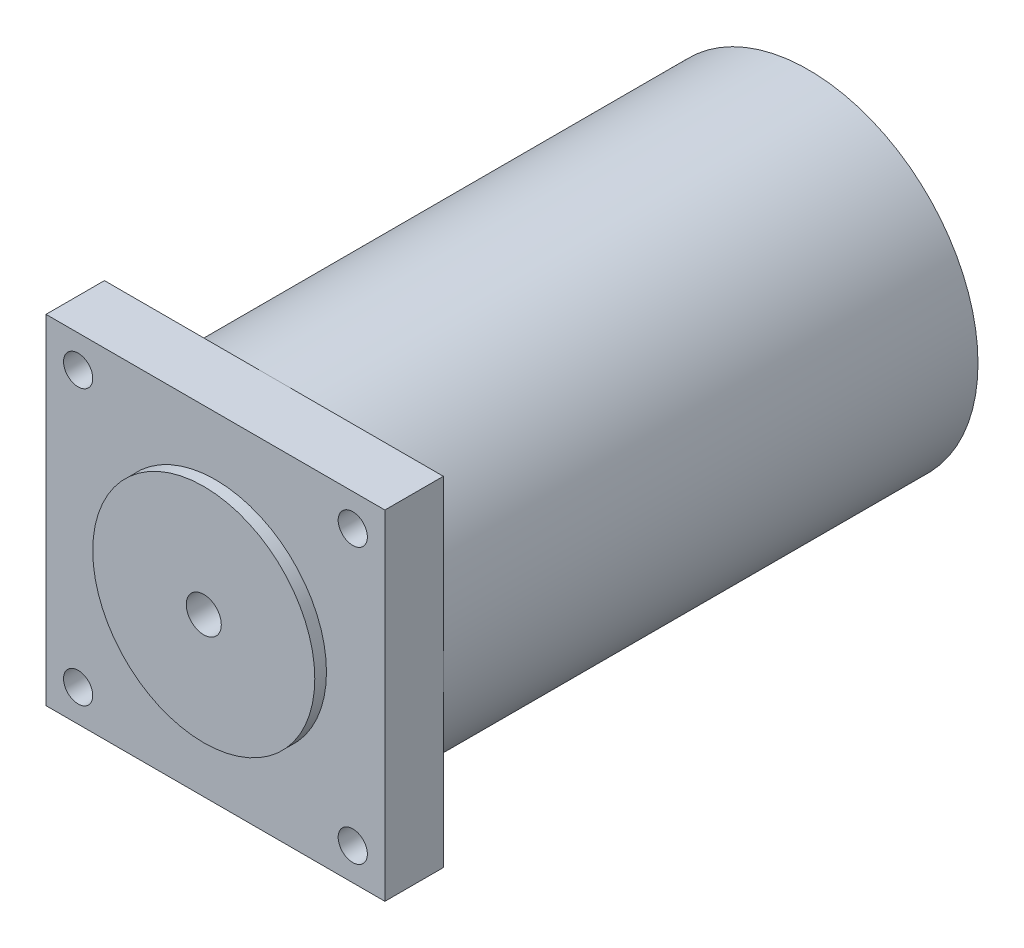
ISO-10303-21;
HEADER;
FILE_DESCRIPTION(('STEP AP214'),'2;1');
FILE_NAME('part.step','',(''),(''),'','','');
FILE_SCHEMA(('AUTOMOTIVE_DESIGN { 1 0 10303 214 1 1 1 1 }'));
ENDSEC;
DATA;
#1=APPLICATION_CONTEXT('core data for automotive mechanical design processes');
#2=APPLICATION_PROTOCOL_DEFINITION('international standard','automotive_design',2000,#1);
#3=PRODUCT_CONTEXT('',#1,'mechanical');
#4=PRODUCT('Part','Part','',(#3));
#5=PRODUCT_RELATED_PRODUCT_CATEGORY('part','',(#4));
#6=PRODUCT_DEFINITION_FORMATION('','',#4);
#7=PRODUCT_DEFINITION_CONTEXT('part definition',#1,'design');
#8=PRODUCT_DEFINITION('design','',#6,#7);
#9=PRODUCT_DEFINITION_SHAPE('','',#8);
#10=(LENGTH_UNIT() NAMED_UNIT(*) SI_UNIT(.MILLI.,.METRE.));
#11=(NAMED_UNIT(*) PLANE_ANGLE_UNIT() SI_UNIT($,.RADIAN.));
#12=(NAMED_UNIT(*) SI_UNIT($,.STERADIAN.) SOLID_ANGLE_UNIT());
#13=UNCERTAINTY_MEASURE_WITH_UNIT(LENGTH_MEASURE(1.E-05),#10,'distance_accuracy_value','');
#14=(GEOMETRIC_REPRESENTATION_CONTEXT(3) GLOBAL_UNCERTAINTY_ASSIGNED_CONTEXT((#13)) GLOBAL_UNIT_ASSIGNED_CONTEXT((#10,
#11,#12)) REPRESENTATION_CONTEXT('',''));
#15=CARTESIAN_POINT('',(0.,0.,0.));
#16=DIRECTION('',(0.,0.,1.));
#17=DIRECTION('',(1.,0.,0.));
#18=AXIS2_PLACEMENT_3D('',#15,#16,#17);
#19=CARTESIAN_POINT('',(0.,0.,-12.));
#20=DIRECTION('',(0.,0.,-1.));
#21=DIRECTION('',(-1.,0.,0.));
#22=AXIS2_PLACEMENT_3D('',#19,#20,#21);
#23=PLANE('',#22);
#24=CARTESIAN_POINT('',(-23.5,23.5,-12.));
#25=DIRECTION('',(0.,0.,1.));
#26=DIRECTION('',(1.,0.,0.));
#27=AXIS2_PLACEMENT_3D('',#24,#25,#26);
#28=CIRCLE('',#27,2.5);
#29=CARTESIAN_POINT('',(-21.,23.5,-12.));
#30=VERTEX_POINT('',#29);
#31=EDGE_CURVE('E112',#30,#30,#28,.T.);
#32=ORIENTED_EDGE('',*,*,#31,.T.);
#33=EDGE_LOOP('',(#32));
#34=FACE_BOUND('',#33,.T.);
#35=CARTESIAN_POINT('',(0.,0.,-12.));
#36=DIRECTION('',(0.,0.,-1.));
#37=DIRECTION('',(-1.,0.,0.));
#38=AXIS2_PLACEMENT_3D('',#35,#36,#37);
#39=CIRCLE('',#38,29.);
#40=CARTESIAN_POINT('',(-29.,0.,-12.));
#41=VERTEX_POINT('',#40);
#42=CARTESIAN_POINT('',(0.,29.,-12.));
#43=VERTEX_POINT('',#42);
#44=EDGE_CURVE('E108',#41,#43,#39,.T.);
#45=ORIENTED_EDGE('',*,*,#44,.F.);
#46=DIRECTION('',(0.,1.,0.));
#47=VECTOR('',#46,1.);
#48=CARTESIAN_POINT('',(-29.,29.,-12.));
#49=LINE('',#48,#47);
#50=CARTESIAN_POINT('',(-29.,29.,-12.));
#51=VERTEX_POINT('',#50);
#52=EDGE_CURVE('E96',#41,#51,#49,.T.);
#53=ORIENTED_EDGE('',*,*,#52,.T.);
#54=DIRECTION('',(1.,0.,0.));
#55=VECTOR('',#54,1.);
#56=CARTESIAN_POINT('',(29.,29.,-12.));
#57=LINE('',#56,#55);
#58=EDGE_CURVE('E109',#51,#43,#57,.T.);
#59=ORIENTED_EDGE('',*,*,#58,.T.);
#60=EDGE_LOOP('',(#45,#53,#59));
#61=FACE_BOUND('',#60,.T.);
#62=ADVANCED_FACE('F33',(#34,#61),#23,.T.);
#63=CARTESIAN_POINT('',(23.5,23.5,-12.));
#64=DIRECTION('',(0.,0.,1.));
#65=DIRECTION('',(-1.,0.,0.));
#66=AXIS2_PLACEMENT_3D('',#63,#64,#65);
#67=CIRCLE('',#66,2.5);
#68=CARTESIAN_POINT('',(21.,23.5,-12.));
#69=VERTEX_POINT('',#68);
#70=EDGE_CURVE('E227',#69,#69,#67,.T.);
#71=ORIENTED_EDGE('',*,*,#70,.T.);
#72=EDGE_LOOP('',(#71));
#73=FACE_BOUND('',#72,.T.);
#74=CARTESIAN_POINT('',(29.,0.,-12.));
#75=VERTEX_POINT('',#74);
#76=EDGE_CURVE('E45',#43,#75,#39,.T.);
#77=ORIENTED_EDGE('',*,*,#76,.F.);
#78=CARTESIAN_POINT('',(29.,29.,-12.));
#79=VERTEX_POINT('',#78);
#80=EDGE_CURVE('E95',#43,#79,#57,.T.);
#81=ORIENTED_EDGE('',*,*,#80,.T.);
#82=DIRECTION('',(0.,-1.,0.));
#83=VECTOR('',#82,1.);
#84=CARTESIAN_POINT('',(29.,29.,-12.));
#85=LINE('',#84,#83);
#86=EDGE_CURVE('E123',#79,#75,#85,.T.);
#87=ORIENTED_EDGE('',*,*,#86,.T.);
#88=EDGE_LOOP('',(#77,#81,#87));
#89=FACE_BOUND('',#88,.T.);
#90=ADVANCED_FACE('F168',(#73,#89),#23,.T.);
#91=CARTESIAN_POINT('',(23.5,-23.5,-12.));
#92=DIRECTION('',(0.,0.,1.));
#93=DIRECTION('',(1.,0.,0.));
#94=AXIS2_PLACEMENT_3D('',#91,#92,#93);
#95=CIRCLE('',#94,2.5);
#96=CARTESIAN_POINT('',(26.,-23.5,-12.));
#97=VERTEX_POINT('',#96);
#98=EDGE_CURVE('E221',#97,#97,#95,.T.);
#99=ORIENTED_EDGE('',*,*,#98,.T.);
#100=EDGE_LOOP('',(#99));
#101=FACE_BOUND('',#100,.T.);
#102=CARTESIAN_POINT('',(0.,-29.,-12.));
#103=VERTEX_POINT('',#102);
#104=EDGE_CURVE('E116',#75,#103,#39,.T.);
#105=ORIENTED_EDGE('',*,*,#104,.F.);
#106=CARTESIAN_POINT('',(29.,-29.,-12.));
#107=VERTEX_POINT('',#106);
#108=EDGE_CURVE('E125',#75,#107,#85,.T.);
#109=ORIENTED_EDGE('',*,*,#108,.T.);
#110=DIRECTION('',(-1.,0.,0.));
#111=VECTOR('',#110,1.);
#112=CARTESIAN_POINT('',(29.,-29.,-12.));
#113=LINE('',#112,#111);
#114=EDGE_CURVE('E106',#107,#103,#113,.T.);
#115=ORIENTED_EDGE('',*,*,#114,.T.);
#116=EDGE_LOOP('',(#105,#109,#115));
#117=FACE_BOUND('',#116,.T.);
#118=ADVANCED_FACE('F170',(#101,#117),#23,.T.);
#119=CARTESIAN_POINT('',(0.,0.,-2.));
#120=DIRECTION('',(0.,0.,1.));
#121=DIRECTION('',(1.,0.,0.));
#122=AXIS2_PLACEMENT_3D('',#119,#120,#121);
#123=CYLINDRICAL_SURFACE('',#122,19.);
#124=CARTESIAN_POINT('',(0.,0.,-2.));
#125=DIRECTION('',(0.,0.,-1.));
#126=DIRECTION('',(-1.,0.,0.));
#127=AXIS2_PLACEMENT_3D('',#124,#125,#126);
#128=CIRCLE('',#127,19.);
#129=CARTESIAN_POINT('',(-19.,0.,-2.));
#130=VERTEX_POINT('',#129);
#131=EDGE_CURVE('E119',#130,#130,#128,.F.);
#132=ORIENTED_EDGE('',*,*,#131,.T.);
#133=EDGE_LOOP('',(#132));
#134=FACE_BOUND('',#133,.T.);
#135=CARTESIAN_POINT('',(0.,0.,0.));
#136=DIRECTION('',(0.,0.,1.));
#137=DIRECTION('',(1.,0.,0.));
#138=AXIS2_PLACEMENT_3D('',#135,#136,#137);
#139=CIRCLE('',#138,19.);
#140=CARTESIAN_POINT('',(19.,0.,0.));
#141=VERTEX_POINT('',#140);
#142=EDGE_CURVE('E117',#141,#141,#139,.T.);
#143=ORIENTED_EDGE('',*,*,#142,.F.);
#144=EDGE_LOOP('',(#143));
#145=FACE_BOUND('',#144,.T.);
#146=ADVANCED_FACE('F35',(#134,#145),#123,.T.);
#147=CARTESIAN_POINT('',(0.,0.,0.));
#148=DIRECTION('',(0.,0.,1.));
#149=DIRECTION('',(1.,0.,0.));
#150=AXIS2_PLACEMENT_3D('',#147,#148,#149);
#151=PLANE('',#150);
#152=CARTESIAN_POINT('',(0.,0.,0.));
#153=DIRECTION('',(0.,0.,1.));
#154=DIRECTION('',(1.,0.,0.));
#155=AXIS2_PLACEMENT_3D('',#152,#153,#154);
#156=CIRCLE('',#155,3.);
#157=CARTESIAN_POINT('',(3.,0.,0.));
#158=VERTEX_POINT('',#157);
#159=EDGE_CURVE('E203',#158,#158,#156,.T.);
#160=ORIENTED_EDGE('',*,*,#159,.F.);
#161=EDGE_LOOP('',(#160));
#162=FACE_BOUND('',#161,.T.);
#163=ORIENTED_EDGE('',*,*,#142,.T.);
#164=EDGE_LOOP('',(#163));
#165=FACE_BOUND('',#164,.T.);
#166=ADVANCED_FACE('F194',(#162,#165),#151,.T.);
#167=CARTESIAN_POINT('',(29.,29.,-12.));
#168=DIRECTION('',(-1.,0.,0.));
#169=DIRECTION('',(0.,0.,1.));
#170=AXIS2_PLACEMENT_3D('',#167,#168,#169);
#171=PLANE('',#170);
#172=DIRECTION('',(0.,-1.,0.));
#173=VECTOR('',#172,1.);
#174=CARTESIAN_POINT('',(29.,29.,-2.));
#175=LINE('',#174,#173);
#176=CARTESIAN_POINT('',(29.,29.,-2.));
#177=VERTEX_POINT('',#176);
#178=CARTESIAN_POINT('',(29.,-29.,-2.));
#179=VERTEX_POINT('',#178);
#180=EDGE_CURVE('E130',#177,#179,#175,.T.);
#181=ORIENTED_EDGE('',*,*,#180,.T.);
#182=DIRECTION('',(0.,0.,1.));
#183=VECTOR('',#182,1.);
#184=CARTESIAN_POINT('',(29.,-29.,-12.));
#185=LINE('',#184,#183);
#186=EDGE_CURVE('E144',#107,#179,#185,.T.);
#187=ORIENTED_EDGE('',*,*,#186,.F.);
#188=ORIENTED_EDGE('',*,*,#108,.F.);
#189=ORIENTED_EDGE('',*,*,#86,.F.);
#190=DIRECTION('',(0.,0.,1.));
#191=VECTOR('',#190,1.);
#192=CARTESIAN_POINT('',(29.,29.,-12.));
#193=LINE('',#192,#191);
#194=EDGE_CURVE('E129',#79,#177,#193,.T.);
#195=ORIENTED_EDGE('',*,*,#194,.T.);
#196=EDGE_LOOP('',(#181,#187,#188,#189,#195));
#197=FACE_BOUND('',#196,.T.);
#198=ADVANCED_FACE('F162',(#197),#171,.F.);
#199=CARTESIAN_POINT('',(29.,-29.,-12.));
#200=DIRECTION('',(0.,1.,0.));
#201=DIRECTION('',(-1.,0.,0.));
#202=AXIS2_PLACEMENT_3D('',#199,#200,#201);
#203=PLANE('',#202);
#204=DIRECTION('',(-1.,0.,0.));
#205=VECTOR('',#204,1.);
#206=CARTESIAN_POINT('',(29.,-29.,-2.));
#207=LINE('',#206,#205);
#208=CARTESIAN_POINT('',(-29.,-29.,-2.));
#209=VERTEX_POINT('',#208);
#210=EDGE_CURVE('E133',#179,#209,#207,.T.);
#211=ORIENTED_EDGE('',*,*,#210,.T.);
#212=DIRECTION('',(0.,0.,1.));
#213=VECTOR('',#212,1.);
#214=CARTESIAN_POINT('',(-29.,-29.,-12.));
#215=LINE('',#214,#213);
#216=CARTESIAN_POINT('',(-29.,-29.,-12.));
#217=VERTEX_POINT('',#216);
#218=EDGE_CURVE('E142',#217,#209,#215,.T.);
#219=ORIENTED_EDGE('',*,*,#218,.F.);
#220=EDGE_CURVE('E91',#103,#217,#113,.T.);
#221=ORIENTED_EDGE('',*,*,#220,.F.);
#222=ORIENTED_EDGE('',*,*,#114,.F.);
#223=ORIENTED_EDGE('',*,*,#186,.T.);
#224=EDGE_LOOP('',(#211,#219,#221,#222,#223));
#225=FACE_BOUND('',#224,.T.);
#226=ADVANCED_FACE('F189',(#225),#203,.F.);
#227=CARTESIAN_POINT('',(-29.,29.,-12.));
#228=DIRECTION('',(1.,0.,0.));
#229=DIRECTION('',(0.,0.,-1.));
#230=AXIS2_PLACEMENT_3D('',#227,#228,#229);
#231=PLANE('',#230);
#232=DIRECTION('',(0.,1.,0.));
#233=VECTOR('',#232,1.);
#234=CARTESIAN_POINT('',(-29.,29.,-2.));
#235=LINE('',#234,#233);
#236=CARTESIAN_POINT('',(-29.,29.,-2.));
#237=VERTEX_POINT('',#236);
#238=EDGE_CURVE('E135',#209,#237,#235,.T.);
#239=ORIENTED_EDGE('',*,*,#238,.T.);
#240=DIRECTION('',(0.,0.,1.));
#241=VECTOR('',#240,1.);
#242=CARTESIAN_POINT('',(-29.,29.,-12.));
#243=LINE('',#242,#241);
#244=EDGE_CURVE('E102',#51,#237,#243,.T.);
#245=ORIENTED_EDGE('',*,*,#244,.F.);
#246=ORIENTED_EDGE('',*,*,#52,.F.);
#247=EDGE_CURVE('E88',#217,#41,#49,.T.);
#248=ORIENTED_EDGE('',*,*,#247,.F.);
#249=ORIENTED_EDGE('',*,*,#218,.T.);
#250=EDGE_LOOP('',(#239,#245,#246,#248,#249));
#251=FACE_BOUND('',#250,.T.);
#252=ADVANCED_FACE('F100',(#251),#231,.F.);
#253=CARTESIAN_POINT('',(29.,29.,-12.));
#254=DIRECTION('',(0.,-1.,0.));
#255=DIRECTION('',(0.,0.,-1.));
#256=AXIS2_PLACEMENT_3D('',#253,#254,#255);
#257=PLANE('',#256);
#258=DIRECTION('',(1.,0.,0.));
#259=VECTOR('',#258,1.);
#260=CARTESIAN_POINT('',(29.,29.,-2.));
#261=LINE('',#260,#259);
#262=EDGE_CURVE('E137',#237,#177,#261,.T.);
#263=ORIENTED_EDGE('',*,*,#262,.T.);
#264=ORIENTED_EDGE('',*,*,#194,.F.);
#265=ORIENTED_EDGE('',*,*,#80,.F.);
#266=ORIENTED_EDGE('',*,*,#58,.F.);
#267=ORIENTED_EDGE('',*,*,#244,.T.);
#268=EDGE_LOOP('',(#263,#264,#265,#266,#267));
#269=FACE_BOUND('',#268,.T.);
#270=ADVANCED_FACE('F167',(#269),#257,.F.);
#271=CARTESIAN_POINT('',(-23.5,-23.5,-12.));
#272=DIRECTION('',(0.,0.,1.));
#273=DIRECTION('',(-1.,0.,0.));
#274=AXIS2_PLACEMENT_3D('',#271,#272,#273);
#275=CIRCLE('',#274,2.5);
#276=CARTESIAN_POINT('',(-26.,-23.5,-12.));
#277=VERTEX_POINT('',#276);
#278=EDGE_CURVE('E215',#277,#277,#275,.T.);
#279=ORIENTED_EDGE('',*,*,#278,.T.);
#280=EDGE_LOOP('',(#279));
#281=FACE_BOUND('',#280,.T.);
#282=EDGE_CURVE('E59',#103,#41,#39,.T.);
#283=ORIENTED_EDGE('',*,*,#282,.F.);
#284=ORIENTED_EDGE('',*,*,#220,.T.);
#285=ORIENTED_EDGE('',*,*,#247,.T.);
#286=EDGE_LOOP('',(#283,#284,#285));
#287=FACE_BOUND('',#286,.T.);
#288=ADVANCED_FACE('F90',(#281,#287),#23,.T.);
#289=CARTESIAN_POINT('',(0.,0.,-2.));
#290=DIRECTION('',(0.,0.,-1.));
#291=DIRECTION('',(-1.,0.,0.));
#292=AXIS2_PLACEMENT_3D('',#289,#290,#291);
#293=PLANE('',#292);
#294=CARTESIAN_POINT('',(-23.5,-23.5,-2.));
#295=DIRECTION('',(0.,0.,1.));
#296=DIRECTION('',(-1.,0.,0.));
#297=AXIS2_PLACEMENT_3D('',#294,#295,#296);
#298=CIRCLE('',#297,2.5);
#299=CARTESIAN_POINT('',(-26.,-23.5,-2.));
#300=VERTEX_POINT('',#299);
#301=EDGE_CURVE('E210',#300,#300,#298,.T.);
#302=ORIENTED_EDGE('',*,*,#301,.F.);
#303=EDGE_LOOP('',(#302));
#304=FACE_BOUND('',#303,.T.);
#305=CARTESIAN_POINT('',(23.5,-23.5,-2.));
#306=DIRECTION('',(0.,0.,1.));
#307=DIRECTION('',(1.,0.,0.));
#308=AXIS2_PLACEMENT_3D('',#305,#306,#307);
#309=CIRCLE('',#308,2.5);
#310=CARTESIAN_POINT('',(26.,-23.5,-2.));
#311=VERTEX_POINT('',#310);
#312=EDGE_CURVE('E218',#311,#311,#309,.T.);
#313=ORIENTED_EDGE('',*,*,#312,.F.);
#314=EDGE_LOOP('',(#313));
#315=FACE_BOUND('',#314,.T.);
#316=CARTESIAN_POINT('',(23.5,23.5,-2.));
#317=DIRECTION('',(0.,0.,1.));
#318=DIRECTION('',(-1.,0.,0.));
#319=AXIS2_PLACEMENT_3D('',#316,#317,#318);
#320=CIRCLE('',#319,2.5);
#321=CARTESIAN_POINT('',(21.,23.5,-2.));
#322=VERTEX_POINT('',#321);
#323=EDGE_CURVE('E224',#322,#322,#320,.T.);
#324=ORIENTED_EDGE('',*,*,#323,.F.);
#325=EDGE_LOOP('',(#324));
#326=FACE_BOUND('',#325,.T.);
#327=CARTESIAN_POINT('',(-23.5,23.5,-2.));
#328=DIRECTION('',(0.,0.,1.));
#329=DIRECTION('',(1.,0.,0.));
#330=AXIS2_PLACEMENT_3D('',#327,#328,#329);
#331=CIRCLE('',#330,2.5);
#332=CARTESIAN_POINT('',(-21.,23.5,-2.));
#333=VERTEX_POINT('',#332);
#334=EDGE_CURVE('E229',#333,#333,#331,.T.);
#335=ORIENTED_EDGE('',*,*,#334,.F.);
#336=EDGE_LOOP('',(#335));
#337=FACE_BOUND('',#336,.T.);
#338=ORIENTED_EDGE('',*,*,#131,.F.);
#339=EDGE_LOOP('',(#338));
#340=FACE_BOUND('',#339,.T.);
#341=ORIENTED_EDGE('',*,*,#180,.F.);
#342=ORIENTED_EDGE('',*,*,#262,.F.);
#343=ORIENTED_EDGE('',*,*,#238,.F.);
#344=ORIENTED_EDGE('',*,*,#210,.F.);
#345=EDGE_LOOP('',(#341,#342,#343,#344));
#346=FACE_BOUND('',#345,.T.);
#347=ADVANCED_FACE('F152',(#304,#315,#326,#337,#340,#346),#293,.F.);
#348=CARTESIAN_POINT('',(0.,0.,-103.5));
#349=DIRECTION('',(0.,0.,1.));
#350=DIRECTION('',(1.,0.,0.));
#351=AXIS2_PLACEMENT_3D('',#348,#349,#350);
#352=CYLINDRICAL_SURFACE('',#351,29.);
#353=CARTESIAN_POINT('',(-29.,0.,-90.));
#354=CARTESIAN_POINT('',(-28.9999994814004,0.0841952568733352,-89.999996285564));
#355=CARTESIAN_POINT('',(-28.999629409528,0.168450128231977,-89.992887348596));
#356=CARTESIAN_POINT('',(-28.9981886967874,0.334635306466976,-89.9646293585502));
#357=CARTESIAN_POINT('',(-28.99711723176,0.416562760241089,-89.9434637880521));
#358=CARTESIAN_POINT('',(-28.994394997039,0.575661719286378,-89.887700387204));
#359=CARTESIAN_POINT('',(-28.9927445239121,0.652835635564873,-89.8531094323433));
#360=CARTESIAN_POINT('',(-28.9890501248228,0.800260819726807,-89.7714878113173));
#361=CARTESIAN_POINT('',(-28.9870062914241,0.870513710365758,-89.7244600707473));
#362=CARTESIAN_POINT('',(-28.9827526204579,1.00219868527525,-89.6192438970584));
#363=CARTESIAN_POINT('',(-28.9805426289382,1.06362243168234,-89.5610450339458));
#364=CARTESIAN_POINT('',(-28.9762070467588,1.17583443056522,-89.4351596054024));
#365=CARTESIAN_POINT('',(-28.9740814595594,1.22662224736012,-89.3674726514993));
#366=CARTESIAN_POINT('',(-28.9701532754793,1.31614415555075,-89.224488096196));
#367=CARTESIAN_POINT('',(-28.9683508551826,1.35487166544372,-89.1491863688794));
#368=CARTESIAN_POINT('',(-28.965274155424,1.41913142371409,-88.9931388305909));
#369=CARTESIAN_POINT('',(-28.9639998717462,1.44466377742115,-88.9123930630815));
#370=CARTESIAN_POINT('',(-28.9621245481971,1.48178623562018,-88.7478268449756));
#371=CARTESIAN_POINT('',(-28.9615229010872,1.49338891615407,-88.6640092382833));
#372=CARTESIAN_POINT('',(-28.9610588749841,1.50236147501093,-88.4956140489785));
#373=CARTESIAN_POINT('',(-28.9611964898406,1.49973147174335,-88.4110364726943));
#374=CARTESIAN_POINT('',(-28.9621949047086,1.48032378915431,-88.2436076986657));
#375=CARTESIAN_POINT('',(-28.9630550100155,1.46355970028624,-88.1607549208528));
#376=CARTESIAN_POINT('',(-28.9654003710499,1.41638078069162,-87.9990410408175));
#377=CARTESIAN_POINT('',(-28.9668856295571,1.3859658892663,-87.9201799563461));
#378=CARTESIAN_POINT('',(-28.9703146988802,1.31233322244595,-87.768644271517));
#379=CARTESIAN_POINT('',(-28.9722587313834,1.2691092548968,-87.6959726852067));
#380=CARTESIAN_POINT('',(-28.9763860157147,1.17108991348463,-87.5589118404958));
#381=CARTESIAN_POINT('',(-28.9785692693558,1.11629445191383,-87.4945226448787));
#382=CARTESIAN_POINT('',(-28.9829320138345,0.996610889898645,-87.3757752571403));
#383=CARTESIAN_POINT('',(-28.9851114972501,0.93171102146714,-87.3214289248008));
#384=CARTESIAN_POINT('',(-28.9892185895455,0.793702259670564,-87.2244013562772));
#385=CARTESIAN_POINT('',(-28.9911461983604,0.720593364192884,-87.1817201230952));
#386=CARTESIAN_POINT('',(-28.9945323936625,0.56823487191116,-87.109235436918));
#387=CARTESIAN_POINT('',(-28.9959909649161,0.488985075763274,-87.0794324021772));
#388=CARTESIAN_POINT('',(-28.99827448507,0.326597487471827,-87.0335578848933));
#389=CARTESIAN_POINT('',(-28.9990994390449,0.243459726472143,-87.0174862923766));
#390=CARTESIAN_POINT('',(-29.0000221002627,0.0757591356689684,-86.9995455000349));
#391=CARTESIAN_POINT('',(-29.0001206474517,-0.00880193487156638,-86.9976598968592));
#392=CARTESIAN_POINT('',(-28.9995816194342,-0.177039267823699,-87.008101794759));
#393=CARTESIAN_POINT('',(-28.9989440468361,-0.260715533369488,-87.0204292454714));
#394=CARTESIAN_POINT('',(-28.9970051267962,-0.424761998819716,-87.0589337427039));
#395=CARTESIAN_POINT('',(-28.9957041385483,-0.505133962356042,-87.0851032949644));
#396=CARTESIAN_POINT('',(-28.9925848471614,-0.660344699611395,-87.1505415381838));
#397=CARTESIAN_POINT('',(-28.9907665408341,-0.73518343922581,-87.189810309873));
#398=CARTESIAN_POINT('',(-28.9868150412848,-0.877278624557046,-87.2803742623094));
#399=CARTESIAN_POINT('',(-28.9846815609571,-0.94452805726732,-87.3316804337808));
#400=CARTESIAN_POINT('',(-28.9803409216317,-1.06946513977656,-87.4448467415006));
#401=CARTESIAN_POINT('',(-28.97813376213,-1.12715272415435,-87.5067069499529));
#402=CARTESIAN_POINT('',(-28.9738921325879,-1.23138383825736,-87.639295938405));
#403=CARTESIAN_POINT('',(-28.9718578282446,-1.27791675132627,-87.7100330704098));
#404=CARTESIAN_POINT('',(-28.9681939186281,-1.3584450557728,-87.8583257657261));
#405=CARTESIAN_POINT('',(-28.9665643115014,-1.39244050457188,-87.9358812978074));
#406=CARTESIAN_POINT('',(-28.9638947455094,-1.44691037878997,-88.0955700131851));
#407=CARTESIAN_POINT('',(-28.9628544919943,-1.46739156156762,-88.1777008864219));
#408=CARTESIAN_POINT('',(-28.9614801126643,-1.49427361516323,-88.3442411872332));
#409=CARTESIAN_POINT('',(-28.9611459824674,-1.50067457335729,-88.4286506006647));
#410=CARTESIAN_POINT('',(-28.9612216369391,-1.49921365171567,-88.5972462457095));
#411=CARTESIAN_POINT('',(-28.9616305505706,-1.49136847199661,-88.6814326229357));
#412=CARTESIAN_POINT('',(-28.9631443648258,-1.46167250473789,-88.8472913028772));
#413=CARTESIAN_POINT('',(-28.9642492667687,-1.43982169065088,-88.9289636008267));
#414=CARTESIAN_POINT('',(-28.9670303303492,-1.38273818302386,-89.0874790977661));
#415=CARTESIAN_POINT('',(-28.9687064953284,-1.34750541120768,-89.1643222685054));
#416=CARTESIAN_POINT('',(-28.9724411218353,-1.2646608963442,-89.3110038587283));
#417=CARTESIAN_POINT('',(-28.9744995718613,-1.21704952571139,-89.3808424888583));
#418=CARTESIAN_POINT('',(-28.9787695317164,-1.11073916628571,-89.5116161802099));
#419=CARTESIAN_POINT('',(-28.9809812017525,-1.05202845767749,-89.5725417083404));
#420=CARTESIAN_POINT('',(-28.9853071615423,-0.925195196656793,-89.6836911299586));
#421=CARTESIAN_POINT('',(-28.9874214272223,-0.857070333981883,-89.7339123888707));
#422=CARTESIAN_POINT('',(-28.9913158872774,-0.713286126999061,-89.822252824604));
#423=CARTESIAN_POINT('',(-28.9930957479604,-0.637619370873319,-89.8603599390688));
#424=CARTESIAN_POINT('',(-28.9961159255912,-0.481009048877493,-89.9232834444534));
#425=CARTESIAN_POINT('',(-28.9973568788256,-0.400071836437397,-89.9481155172337));
#426=CARTESIAN_POINT('',(-28.9988315599369,-0.265527256500407,-89.9772779447363));
#427=CARTESIAN_POINT('',(-28.9992677966319,-0.212791142176882,-89.9857878196772));
#428=CARTESIAN_POINT('',(-28.9998521808899,-0.106711335361803,-89.9971500219224));
#429=CARTESIAN_POINT('',(-29.0000003287173,-0.053367643427623,-90.0000023544165));
#430=CARTESIAN_POINT('',(-29.,0.,-90.));
#431=B_SPLINE_CURVE_WITH_KNOTS('',3,(#353,#354,#355,#356,#357,#358,#359,#360,#361,#362,#363,
#364,#365,#366,#367,#368,#369,#370,#371,#372,#373,#374,#375,#376,#377,#378,#379,#380,#381,#382,
#383,#384,#385,#386,#387,#388,#389,#390,#391,#392,#393,#394,#395,#396,#397,#398,#399,#400,#401,
#402,#403,#404,#405,#406,#407,#408,#409,#410,#411,#412,#413,#414,#415,#416,#417,#418,#419,#420,
#421,#422,#423,#424,#425,#426,#427,#428,#429,#430),.UNSPECIFIED.,.T.,.F.,(4,2,2,2,2,2,2,2,2,2,2,
2,2,2,2,2,2,2,2,2,2,2,2,2,2,2,2,2,2,2,2,2,2,2,2,2,2,2,4),(0.,0.252390957355242,
0.505079015795183,0.757637836487992,1.0101372987038,1.26287366564458,1.51562038343216,
1.76850478842644,2.02138717475265,2.27404108071232,2.52669288470993,2.77910203121319,
3.03151230007371,3.28404478852476,3.53657919115052,3.7894099361653,4.04224074624673,
4.29507976707747,4.54791676293138,4.80046135674322,5.05300505568155,5.30541216454141,
5.55782082900951,5.81046085779168,6.06310261503975,6.31598388225126,6.56886399125461,
6.82161755997024,7.07436956019667,7.32682546169223,7.57928184171356,7.83173969847098,
8.08418996082354,8.33690829003845,8.58968874760984,8.84272012229597,9.09545192576594,
9.25543151929953,9.41541096608421),.UNSPECIFIED.);
#432=CARTESIAN_POINT('',(-29.,0.,-90.));
#433=VERTEX_POINT('',#432);
#434=EDGE_CURVE('E11',#433,#433,#431,.T.);
#435=ORIENTED_EDGE('',*,*,#434,.T.);
#436=EDGE_LOOP('',(#435));
#437=FACE_BOUND('',#436,.T.);
#438=CARTESIAN_POINT('',(0.,0.,-103.5));
#439=DIRECTION('',(0.,0.,-1.));
#440=DIRECTION('',(-1.,0.,0.));
#441=AXIS2_PLACEMENT_3D('',#438,#439,#440);
#442=CIRCLE('',#441,29.);
#443=CARTESIAN_POINT('',(-29.,0.,-103.5));
#444=VERTEX_POINT('',#443);
#445=EDGE_CURVE('E111',#444,#444,#442,.T.);
#446=ORIENTED_EDGE('',*,*,#445,.F.);
#447=EDGE_LOOP('',(#446));
#448=FACE_BOUND('',#447,.T.);
#449=ORIENTED_EDGE('',*,*,#44,.T.);
#450=ORIENTED_EDGE('',*,*,#76,.T.);
#451=ORIENTED_EDGE('',*,*,#104,.T.);
#452=ORIENTED_EDGE('',*,*,#282,.T.);
#453=EDGE_LOOP('',(#449,#450,#451,#452));
#454=FACE_BOUND('',#453,.T.);
#455=ADVANCED_FACE('F115',(#437,#448,#454),#352,.T.);
#456=CARTESIAN_POINT('',(0.,0.,-103.5));
#457=DIRECTION('',(0.,0.,-1.));
#458=DIRECTION('',(-1.,0.,0.));
#459=AXIS2_PLACEMENT_3D('',#456,#457,#458);
#460=PLANE('',#459);
#461=ORIENTED_EDGE('',*,*,#445,.T.);
#462=EDGE_LOOP('',(#461));
#463=FACE_BOUND('',#462,.T.);
#464=ADVANCED_FACE('F240',(#463),#460,.T.);
#465=CARTESIAN_POINT('',(-23.5,23.5,-12.));
#466=DIRECTION('',(0.,0.,1.));
#467=DIRECTION('',(1.,0.,0.));
#468=AXIS2_PLACEMENT_3D('',#465,#466,#467);
#469=CYLINDRICAL_SURFACE('',#468,2.5);
#470=ORIENTED_EDGE('',*,*,#31,.F.);
#471=EDGE_LOOP('',(#470));
#472=FACE_BOUND('',#471,.T.);
#473=ORIENTED_EDGE('',*,*,#334,.T.);
#474=EDGE_LOOP('',(#473));
#475=FACE_BOUND('',#474,.T.);
#476=ADVANCED_FACE('F236',(#472,#475),#469,.F.);
#477=CARTESIAN_POINT('',(23.5,23.5,-12.));
#478=DIRECTION('',(0.,0.,1.));
#479=DIRECTION('',(1.,0.,0.));
#480=AXIS2_PLACEMENT_3D('',#477,#478,#479);
#481=CYLINDRICAL_SURFACE('',#480,2.5);
#482=ORIENTED_EDGE('',*,*,#70,.F.);
#483=EDGE_LOOP('',(#482));
#484=FACE_BOUND('',#483,.T.);
#485=ORIENTED_EDGE('',*,*,#323,.T.);
#486=EDGE_LOOP('',(#485));
#487=FACE_BOUND('',#486,.T.);
#488=ADVANCED_FACE('F239',(#484,#487),#481,.F.);
#489=CARTESIAN_POINT('',(23.5,-23.5,-12.));
#490=DIRECTION('',(0.,0.,1.));
#491=DIRECTION('',(1.,0.,0.));
#492=AXIS2_PLACEMENT_3D('',#489,#490,#491);
#493=CYLINDRICAL_SURFACE('',#492,2.5);
#494=ORIENTED_EDGE('',*,*,#98,.F.);
#495=EDGE_LOOP('',(#494));
#496=FACE_BOUND('',#495,.T.);
#497=ORIENTED_EDGE('',*,*,#312,.T.);
#498=EDGE_LOOP('',(#497));
#499=FACE_BOUND('',#498,.T.);
#500=ADVANCED_FACE('F247',(#496,#499),#493,.F.);
#501=CARTESIAN_POINT('',(-23.5,-23.5,-12.));
#502=DIRECTION('',(0.,0.,1.));
#503=DIRECTION('',(1.,0.,0.));
#504=AXIS2_PLACEMENT_3D('',#501,#502,#503);
#505=CYLINDRICAL_SURFACE('',#504,2.5);
#506=ORIENTED_EDGE('',*,*,#278,.F.);
#507=EDGE_LOOP('',(#506));
#508=FACE_BOUND('',#507,.T.);
#509=ORIENTED_EDGE('',*,*,#301,.T.);
#510=EDGE_LOOP('',(#509));
#511=FACE_BOUND('',#510,.T.);
#512=ADVANCED_FACE('F255',(#508,#511),#505,.F.);
#513=CARTESIAN_POINT('',(0.,0.,-12.));
#514=DIRECTION('',(0.,0.,1.));
#515=DIRECTION('',(1.,0.,0.));
#516=AXIS2_PLACEMENT_3D('',#513,#514,#515);
#517=CYLINDRICAL_SURFACE('',#516,3.);
#518=CARTESIAN_POINT('',(0.,0.,-12.));
#519=DIRECTION('',(0.,0.,1.));
#520=DIRECTION('',(1.,0.,0.));
#521=AXIS2_PLACEMENT_3D('',#518,#519,#520);
#522=CIRCLE('',#521,3.);
#523=CARTESIAN_POINT('',(3.,0.,-12.));
#524=VERTEX_POINT('',#523);
#525=EDGE_CURVE('E206',#524,#524,#522,.T.);
#526=ORIENTED_EDGE('',*,*,#525,.F.);
#527=EDGE_LOOP('',(#526));
#528=FACE_BOUND('',#527,.T.);
#529=ORIENTED_EDGE('',*,*,#159,.T.);
#530=EDGE_LOOP('',(#529));
#531=FACE_BOUND('',#530,.T.);
#532=ADVANCED_FACE('F259',(#528,#531),#517,.F.);
#533=CARTESIAN_POINT('',(0.,0.,-12.));
#534=DIRECTION('',(0.,0.,1.));
#535=DIRECTION('',(1.,0.,0.));
#536=AXIS2_PLACEMENT_3D('',#533,#534,#535);
#537=PLANE('',#536);
#538=ORIENTED_EDGE('',*,*,#525,.T.);
#539=EDGE_LOOP('',(#538));
#540=FACE_BOUND('',#539,.T.);
#541=ADVANCED_FACE('F263',(#540),#537,.T.);
#542=CARTESIAN_POINT('',(-29.,0.,-88.5));
#543=DIRECTION('',(1.,0.,0.));
#544=DIRECTION('',(0.,0.,-1.));
#545=AXIS2_PLACEMENT_3D('',#542,#543,#544);
#546=CYLINDRICAL_SURFACE('',#545,1.5);
#547=CARTESIAN_POINT('',(0.,0.,-88.5));
#548=DIRECTION('',(1.,0.,0.));
#549=DIRECTION('',(0.,0.,-1.));
#550=AXIS2_PLACEMENT_3D('',#547,#548,#549);
#551=CIRCLE('',#550,1.5);
#552=CARTESIAN_POINT('',(0.,0.,-90.));
#553=VERTEX_POINT('',#552);
#554=EDGE_CURVE('E207',#553,#553,#551,.T.);
#555=ORIENTED_EDGE('',*,*,#554,.T.);
#556=EDGE_LOOP('',(#555));
#557=FACE_BOUND('',#556,.T.);
#558=ORIENTED_EDGE('',*,*,#434,.F.);
#559=EDGE_LOOP('',(#558));
#560=FACE_BOUND('',#559,.T.);
#561=ADVANCED_FACE('F266',(#557,#560),#546,.F.);
#562=CARTESIAN_POINT('',(0.,0.,-88.5));
#563=DIRECTION('',(1.,0.,0.));
#564=DIRECTION('',(0.,0.,-1.));
#565=AXIS2_PLACEMENT_3D('',#562,#563,#564);
#566=PLANE('',#565);
#567=ORIENTED_EDGE('',*,*,#554,.F.);
#568=EDGE_LOOP('',(#567));
#569=FACE_BOUND('',#568,.T.);
#570=ADVANCED_FACE('F271',(#569),#566,.F.);
#571=CLOSED_SHELL('',(#62,#90,#118,#146,#166,#198,#226,#252,#270,#288,#347,#455,#464,#476,#488,
#500,#512,#532,#541,#561,#570));
#572=MANIFOLD_SOLID_BREP('B2',#571);
#573=ADVANCED_BREP_SHAPE_REPRESENTATION('',(#18,#572),#14);
#574=SHAPE_DEFINITION_REPRESENTATION(#9,#573);
ENDSEC;
END-ISO-10303-21;
